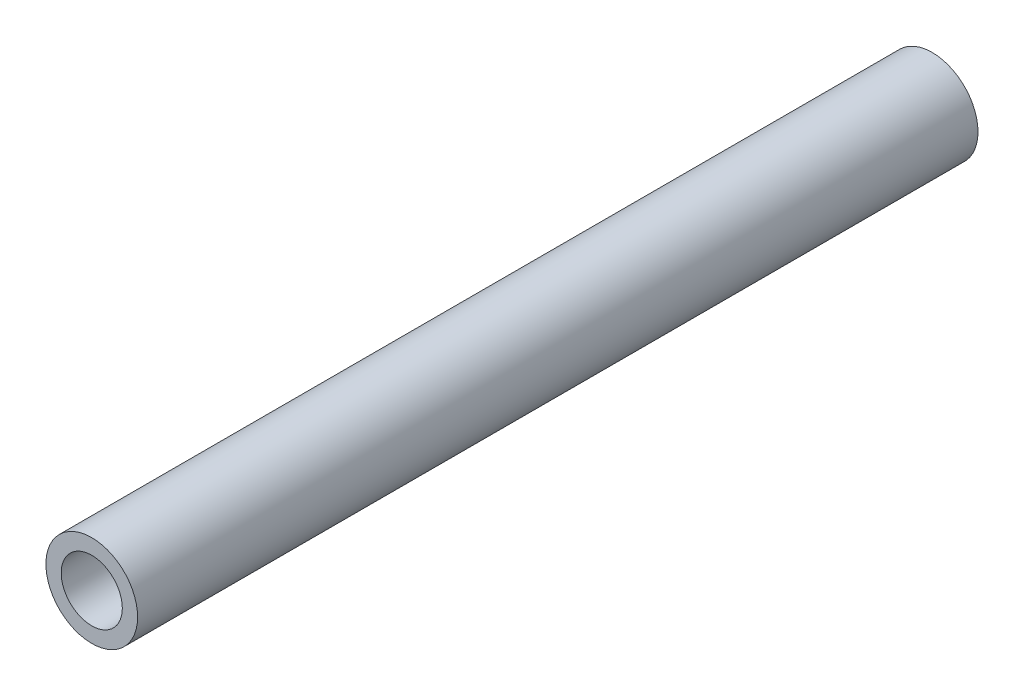
ISO-10303-21;
HEADER;
FILE_DESCRIPTION(('STEP AP214'),'2;1');
FILE_NAME('part.step','',(''),(''),'','','');
FILE_SCHEMA(('AUTOMOTIVE_DESIGN { 1 0 10303 214 1 1 1 1 }'));
ENDSEC;
DATA;
#1=APPLICATION_CONTEXT('core data for automotive mechanical design processes');
#2=APPLICATION_PROTOCOL_DEFINITION('international standard','automotive_design',2000,#1);
#3=PRODUCT_CONTEXT('',#1,'mechanical');
#4=PRODUCT('Part','Part','',(#3));
#5=PRODUCT_RELATED_PRODUCT_CATEGORY('part','',(#4));
#6=PRODUCT_DEFINITION_FORMATION('','',#4);
#7=PRODUCT_DEFINITION_CONTEXT('part definition',#1,'design');
#8=PRODUCT_DEFINITION('design','',#6,#7);
#9=PRODUCT_DEFINITION_SHAPE('','',#8);
#10=(LENGTH_UNIT() NAMED_UNIT(*) SI_UNIT(.MILLI.,.METRE.));
#11=(NAMED_UNIT(*) PLANE_ANGLE_UNIT() SI_UNIT($,.RADIAN.));
#12=(NAMED_UNIT(*) SI_UNIT($,.STERADIAN.) SOLID_ANGLE_UNIT());
#13=UNCERTAINTY_MEASURE_WITH_UNIT(LENGTH_MEASURE(1.E-05),#10,'distance_accuracy_value','');
#14=(GEOMETRIC_REPRESENTATION_CONTEXT(3) GLOBAL_UNCERTAINTY_ASSIGNED_CONTEXT((#13)) GLOBAL_UNIT_ASSIGNED_CONTEXT((#10,
#11,#12)) REPRESENTATION_CONTEXT('',''));
#15=CARTESIAN_POINT('',(0.,0.,0.));
#16=DIRECTION('',(0.,0.,1.));
#17=DIRECTION('',(1.,0.,0.));
#18=AXIS2_PLACEMENT_3D('',#15,#16,#17);
#19=CARTESIAN_POINT('',(0.,0.,27.5));
#20=DIRECTION('',(0.,0.,1.));
#21=DIRECTION('',(1.,0.,0.));
#22=AXIS2_PLACEMENT_3D('',#19,#20,#21);
#23=PLANE('',#22);
#24=CARTESIAN_POINT('',(0.,0.,27.5));
#25=DIRECTION('',(0.,0.,1.));
#26=DIRECTION('',(1.,0.,0.));
#27=AXIS2_PLACEMENT_3D('',#24,#25,#26);
#28=CIRCLE('',#27,3.);
#29=CARTESIAN_POINT('',(3.,0.,27.5));
#30=VERTEX_POINT('',#29);
#31=EDGE_CURVE('E10',#30,#30,#28,.T.);
#32=ORIENTED_EDGE('',*,*,#31,.T.);
#33=EDGE_LOOP('',(#32));
#34=FACE_BOUND('',#33,.T.);
#35=CARTESIAN_POINT('',(0.,0.,27.5));
#36=DIRECTION('',(0.,0.,1.));
#37=DIRECTION('',(1.,0.,0.));
#38=AXIS2_PLACEMENT_3D('',#35,#36,#37);
#39=CIRCLE('',#38,2.);
#40=CARTESIAN_POINT('',(2.,0.,27.5));
#41=VERTEX_POINT('',#40);
#42=EDGE_CURVE('E42',#41,#41,#39,.T.);
#43=ORIENTED_EDGE('',*,*,#42,.F.);
#44=EDGE_LOOP('',(#43));
#45=FACE_BOUND('',#44,.T.);
#46=ADVANCED_FACE('F31',(#34,#45),#23,.T.);
#47=CARTESIAN_POINT('',(0.,0.,-27.5));
#48=DIRECTION('',(0.,0.,1.));
#49=DIRECTION('',(1.,0.,0.));
#50=AXIS2_PLACEMENT_3D('',#47,#48,#49);
#51=PLANE('',#50);
#52=CARTESIAN_POINT('',(0.,0.,-27.5));
#53=DIRECTION('',(0.,0.,1.));
#54=DIRECTION('',(1.,0.,0.));
#55=AXIS2_PLACEMENT_3D('',#52,#53,#54);
#56=CIRCLE('',#55,3.);
#57=CARTESIAN_POINT('',(3.,0.,-27.5));
#58=VERTEX_POINT('',#57);
#59=EDGE_CURVE('E35',#58,#58,#56,.T.);
#60=ORIENTED_EDGE('',*,*,#59,.F.);
#61=EDGE_LOOP('',(#60));
#62=FACE_BOUND('',#61,.T.);
#63=CARTESIAN_POINT('',(0.,0.,-27.5));
#64=DIRECTION('',(0.,0.,1.));
#65=DIRECTION('',(1.,0.,0.));
#66=AXIS2_PLACEMENT_3D('',#63,#64,#65);
#67=CIRCLE('',#66,2.);
#68=CARTESIAN_POINT('',(2.,0.,-27.5));
#69=VERTEX_POINT('',#68);
#70=EDGE_CURVE('E44',#69,#69,#67,.T.);
#71=ORIENTED_EDGE('',*,*,#70,.T.);
#72=EDGE_LOOP('',(#71));
#73=FACE_BOUND('',#72,.T.);
#74=ADVANCED_FACE('F54',(#62,#73),#51,.F.);
#75=CARTESIAN_POINT('',(0.,0.,27.5));
#76=DIRECTION('',(0.,0.,-1.));
#77=DIRECTION('',(-1.,0.,0.));
#78=AXIS2_PLACEMENT_3D('',#75,#76,#77);
#79=CYLINDRICAL_SURFACE('',#78,3.);
#80=ORIENTED_EDGE('',*,*,#31,.F.);
#81=EDGE_LOOP('',(#80));
#82=FACE_BOUND('',#81,.T.);
#83=ORIENTED_EDGE('',*,*,#59,.T.);
#84=EDGE_LOOP('',(#83));
#85=FACE_BOUND('',#84,.T.);
#86=ADVANCED_FACE('F33',(#82,#85),#79,.T.);
#87=CARTESIAN_POINT('',(0.,0.,27.5));
#88=DIRECTION('',(0.,0.,-1.));
#89=DIRECTION('',(-1.,0.,0.));
#90=AXIS2_PLACEMENT_3D('',#87,#88,#89);
#91=CYLINDRICAL_SURFACE('',#90,2.);
#92=ORIENTED_EDGE('',*,*,#42,.T.);
#93=EDGE_LOOP('',(#92));
#94=FACE_BOUND('',#93,.T.);
#95=ORIENTED_EDGE('',*,*,#70,.F.);
#96=EDGE_LOOP('',(#95));
#97=FACE_BOUND('',#96,.T.);
#98=ADVANCED_FACE('F50',(#94,#97),#91,.F.);
#99=CLOSED_SHELL('',(#46,#74,#86,#98));
#100=MANIFOLD_SOLID_BREP('B2',#99);
#101=ADVANCED_BREP_SHAPE_REPRESENTATION('',(#18,#100),#14);
#102=SHAPE_DEFINITION_REPRESENTATION(#9,#101);
ENDSEC;
END-ISO-10303-21;
